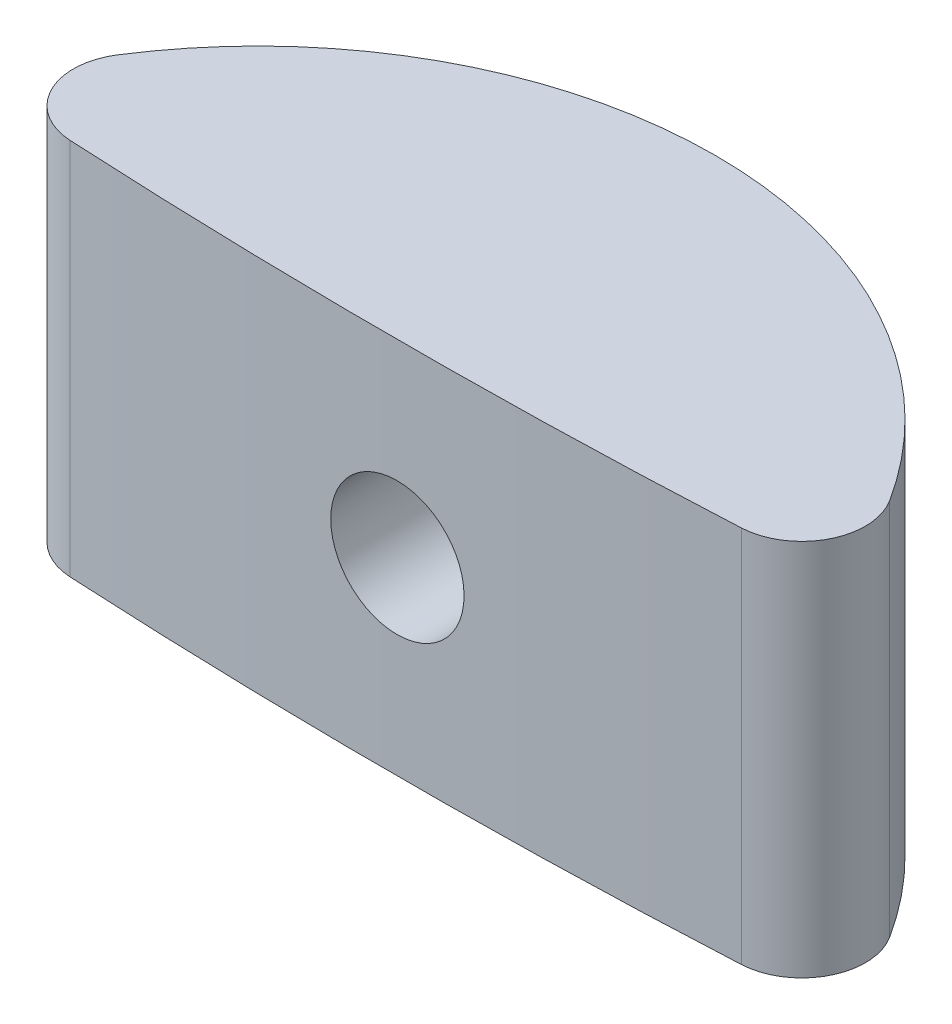
ISO-10303-21;
HEADER;
FILE_DESCRIPTION(('STEP AP214'),'2;1');
FILE_NAME('part.step','',(''),(''),'','','');
FILE_SCHEMA(('AUTOMOTIVE_DESIGN { 1 0 10303 214 1 1 1 1 }'));
ENDSEC;
DATA;
#1=APPLICATION_CONTEXT('core data for automotive mechanical design processes');
#2=APPLICATION_PROTOCOL_DEFINITION('international standard','automotive_design',2000,#1);
#3=PRODUCT_CONTEXT('',#1,'mechanical');
#4=PRODUCT('Part','Part','',(#3));
#5=PRODUCT_RELATED_PRODUCT_CATEGORY('part','',(#4));
#6=PRODUCT_DEFINITION_FORMATION('','',#4);
#7=PRODUCT_DEFINITION_CONTEXT('part definition',#1,'design');
#8=PRODUCT_DEFINITION('design','',#6,#7);
#9=PRODUCT_DEFINITION_SHAPE('','',#8);
#10=(LENGTH_UNIT() NAMED_UNIT(*) SI_UNIT(.MILLI.,.METRE.));
#11=(NAMED_UNIT(*) PLANE_ANGLE_UNIT() SI_UNIT($,.RADIAN.));
#12=(NAMED_UNIT(*) SI_UNIT($,.STERADIAN.) SOLID_ANGLE_UNIT());
#13=UNCERTAINTY_MEASURE_WITH_UNIT(LENGTH_MEASURE(1.E-05),#10,'distance_accuracy_value','');
#14=(GEOMETRIC_REPRESENTATION_CONTEXT(3) GLOBAL_UNCERTAINTY_ASSIGNED_CONTEXT((#13)) GLOBAL_UNIT_ASSIGNED_CONTEXT((#10,
#11,#12)) REPRESENTATION_CONTEXT('',''));
#15=CARTESIAN_POINT('',(0.,0.,0.));
#16=DIRECTION('',(0.,0.,1.));
#17=DIRECTION('',(1.,0.,0.));
#18=AXIS2_PLACEMENT_3D('',#15,#16,#17);
#19=CARTESIAN_POINT('',(2.33146835171283E-12,4.826,-80.010000000007));
#20=DIRECTION('',(0.,-1.,0.));
#21=DIRECTION('',(0.,0.,-1.));
#22=AXIS2_PLACEMENT_3D('',#19,#20,#21);
#23=CYLINDRICAL_SURFACE('',#22,82.0420000000049);
#24=CARTESIAN_POINT('',(2.33146835171283E-12,0.,-80.010000000007));
#25=DIRECTION('',(0.,1.,0.));
#26=DIRECTION('',(0.,0.,1.));
#27=AXIS2_PLACEMENT_3D('',#24,#25,#26);
#28=CIRCLE('',#27,82.0420000000049);
#29=CARTESIAN_POINT('',(-4.28540944867042,0.,1.92000079248676));
#30=VERTEX_POINT('',#29);
#31=CARTESIAN_POINT('',(4.28540944867114,0.,1.92000079248697));
#32=VERTEX_POINT('',#31);
#33=EDGE_CURVE('E94',#30,#32,#28,.T.);
#34=ORIENTED_EDGE('',*,*,#33,.T.);
#35=DIRECTION('',(0.,-1.,0.));
#36=VECTOR('',#35,1.);
#37=CARTESIAN_POINT('',(4.28540944867114,4.826,1.92000079248697));
#38=LINE('',#37,#36);
#39=CARTESIAN_POINT('',(4.28540944867114,4.826,1.92000079248697));
#40=VERTEX_POINT('',#39);
#41=EDGE_CURVE('E47',#40,#32,#38,.T.);
#42=ORIENTED_EDGE('',*,*,#41,.F.);
#43=CARTESIAN_POINT('',(2.33146835171283E-12,4.826,-80.010000000007));
#44=DIRECTION('',(0.,1.,0.));
#45=DIRECTION('',(0.,0.,1.));
#46=AXIS2_PLACEMENT_3D('',#43,#44,#45);
#47=CIRCLE('',#46,82.0420000000049);
#48=CARTESIAN_POINT('',(-4.28540944867042,4.826,1.92000079248676));
#49=VERTEX_POINT('',#48);
#50=EDGE_CURVE('E85',#49,#40,#47,.T.);
#51=ORIENTED_EDGE('',*,*,#50,.F.);
#52=DIRECTION('',(0.,-1.,0.));
#53=VECTOR('',#52,1.);
#54=CARTESIAN_POINT('',(-4.28540944867042,4.826,1.92000079248676));
#55=LINE('',#54,#53);
#56=EDGE_CURVE('E11',#49,#30,#55,.T.);
#57=ORIENTED_EDGE('',*,*,#56,.T.);
#58=EDGE_LOOP('',(#34,#42,#51,#57));
#59=FACE_BOUND('',#58,.T.);
#60=CARTESIAN_POINT('',(-0.8509,2.413,2.02758731940897));
#61=CARTESIAN_POINT('',(-0.85089788100523,2.36520595255424,2.02758737907313));
#62=CARTESIAN_POINT('',(-0.846859684979012,2.31737728263865,2.02762953422608));
#63=CARTESIAN_POINT('',(-0.830806610214287,2.22303726393323,2.02779364614014));
#64=CARTESIAN_POINT('',(-0.818782139031869,2.17652756951929,2.02791569886496));
#65=CARTESIAN_POINT('',(-0.78709894458625,2.0862058978376,2.02822577802736));
#66=CARTESIAN_POINT('',(-0.767443878319103,2.04239263992625,2.02841377285774));
#67=CARTESIAN_POINT('',(-0.721062478651374,1.95870005303107,2.02883451228829));
#68=CARTESIAN_POINT('',(-0.694337899740901,1.91881975134469,2.02906724578145));
#69=CARTESIAN_POINT('',(-0.634569627309472,1.84410545140068,2.02955129052397));
#70=CARTESIAN_POINT('',(-0.601525060732657,1.80927215151591,2.0298026043371));
#71=CARTESIAN_POINT('',(-0.530055641063544,1.74564627937493,2.03029546095536));
#72=CARTESIAN_POINT('',(-0.491630576425896,1.71685394474294,2.03053700337582));
#73=CARTESIAN_POINT('',(-0.410491653677468,1.66612882668587,2.0309830757621));
#74=CARTESIAN_POINT('',(-0.367777778868272,1.6441960699698,2.03118760558381));
#75=CARTESIAN_POINT('',(-0.279273924611517,1.60781303646572,2.03153659197481));
#76=CARTESIAN_POINT('',(-0.233483952083893,1.59336274284592,2.03168104867924));
#77=CARTESIAN_POINT('',(-0.1401293500264,1.57235525084038,2.03189359881309));
#78=CARTESIAN_POINT('',(-0.0925647819037192,1.56579777959618,2.03196169488232));
#79=CARTESIAN_POINT('',(0.0029901061978989,1.56076124835677,2.03201385537093));
#80=CARTESIAN_POINT('',(0.0509804252980764,1.56228217169144,2.03199791996372));
#81=CARTESIAN_POINT('',(0.146022670269315,1.5733589846484,2.03188381672275));
#82=CARTESIAN_POINT('',(0.193074631842418,1.58291456797362,2.03178565202373));
#83=CARTESIAN_POINT('',(0.284906495726545,1.6097889856677,2.03151816052323));
#84=CARTESIAN_POINT('',(0.329686395327418,1.62710782929646,2.03134883363687));
#85=CARTESIAN_POINT('',(0.415703904161632,1.66901748909446,2.03095810193782));
#86=CARTESIAN_POINT('',(0.456941445220939,1.69360844517782,2.03073669612317));
#87=CARTESIAN_POINT('',(0.534702868715446,1.74936415283854,2.03026676727125));
#88=CARTESIAN_POINT('',(0.571226751542507,1.7805289038694,2.03001824423624));
#89=CARTESIAN_POINT('',(0.638525878006982,1.8485492877809,2.02952208475845));
#90=CARTESIAN_POINT('',(0.669300850082892,1.88540518934449,2.0292744483581));
#91=CARTESIAN_POINT('',(0.724226459931421,1.96376070178939,2.02880799301252));
#92=CARTESIAN_POINT('',(0.748377096817142,2.00526031329242,2.02858917407116));
#93=CARTESIAN_POINT('',(0.789368435046018,2.09172533895105,2.02820502510215));
#94=CARTESIAN_POINT('',(0.806209128571292,2.13669075681322,2.0280396951317));
#95=CARTESIAN_POINT('',(0.832102353414275,2.22881089574756,2.0277811667182));
#96=CARTESIAN_POINT('',(0.841154887574468,2.27596561602068,2.0276879682488));
#97=CARTESIAN_POINT('',(0.85121448972571,2.37112342628937,2.02758421464095));
#98=CARTESIAN_POINT('',(0.852221932651851,2.41912647664468,2.02757365565115));
#99=CARTESIAN_POINT('',(0.846163730345619,2.51462035497763,2.02763636140732));
#100=CARTESIAN_POINT('',(0.839098085909796,2.56211118300582,2.02770962614503));
#101=CARTESIAN_POINT('',(0.817094590534489,2.65523145266441,2.02793171594202));
#102=CARTESIAN_POINT('',(0.80215690908447,2.70086093434789,2.02808053937448));
#103=CARTESIAN_POINT('',(0.764833549549312,2.78896445123984,2.02843696664815));
#104=CARTESIAN_POINT('',(0.742447870524762,2.83143848605032,2.02864457049677));
#105=CARTESIAN_POINT('',(0.690863011736532,2.91202712899718,2.02909516257378));
#106=CARTESIAN_POINT('',(0.661663579923948,2.95014157578943,2.02933815211101));
#107=CARTESIAN_POINT('',(0.597280457956959,3.02092748303808,2.02983211611657));
#108=CARTESIAN_POINT('',(0.56209676384698,3.05359893989665,2.03008309059019));
#109=CARTESIAN_POINT('',(0.486742268952576,3.11257266227948,2.03056474053494));
#110=CARTESIAN_POINT('',(0.446571277704496,3.13887468444333,2.03079541523026));
#111=CARTESIAN_POINT('',(0.362383537402801,3.18436121784954,2.03121044801646));
#112=CARTESIAN_POINT('',(0.318366792961425,3.20354573762783,2.03139480616288));
#113=CARTESIAN_POINT('',(0.227737946897198,3.23425228107829,2.03169641780145));
#114=CARTESIAN_POINT('',(0.181125899470119,3.24577446469231,2.03181367269428));
#115=CARTESIAN_POINT('',(0.0866287728709965,3.26082979432869,2.03196786416009));
#116=CARTESIAN_POINT('',(0.0387436918123193,3.26436292851062,2.03200480061404));
#117=CARTESIAN_POINT('',(-0.0569376171426161,3.26333981318263,2.03199419069435));
#118=CARTESIAN_POINT('',(-0.104733849258903,3.25878395823694,2.03194664844139));
#119=CARTESIAN_POINT('',(-0.198883098933066,3.24171297779208,2.03177244869353));
#120=CARTESIAN_POINT('',(-0.245236113592808,3.2291978363109,2.03164579103976));
#121=CARTESIAN_POINT('',(-0.335183906297855,3.19656334602581,2.03132763581885));
#122=CARTESIAN_POINT('',(-0.378778633239205,3.17644385638107,2.03113613705079));
#123=CARTESIAN_POINT('',(-0.461969924176873,3.12917268286453,2.03070989675909));
#124=CARTESIAN_POINT('',(-0.501566643594243,3.10202127250243,2.03047515691743));
#125=CARTESIAN_POINT('',(-0.575637929836373,3.04145872619714,2.02998890357115));
#126=CARTESIAN_POINT('',(-0.610112792065507,3.00804795151583,2.02973739103512));
#127=CARTESIAN_POINT('',(-0.672972837955808,2.93590307871207,2.02924586784042));
#128=CARTESIAN_POINT('',(-0.701356506591239,2.89716766014434,2.02900586005475));
#129=CARTESIAN_POINT('',(-0.75122918751752,2.81546532078416,2.02856436452567));
#130=CARTESIAN_POINT('',(-0.772714760702316,2.77249630320172,2.02836289601652));
#131=CARTESIAN_POINT('',(-0.808142253401932,2.68359444438995,2.02802159337636));
#132=CARTESIAN_POINT('',(-0.822093210672434,2.63766522830148,2.02788168544107));
#133=CARTESIAN_POINT('',(-0.838339735619991,2.56170300728784,2.02771685383285));
#134=CARTESIAN_POINT('',(-0.843043950712254,2.53216352640434,2.02766848789558));
#135=CARTESIAN_POINT('',(-0.849324745309652,2.47275387555845,2.02760370203139));
#136=CARTESIAN_POINT('',(-0.850901324922648,2.44288370560746,2.02758728210336));
#137=CARTESIAN_POINT('',(-0.8509,2.413,2.02758731940897));
#138=B_SPLINE_CURVE_WITH_KNOTS('',3,(#60,#61,#62,#63,#64,#65,#66,#67,#68,#69,#70,#71,#72,#73,
#74,#75,#76,#77,#78,#79,#80,#81,#82,#83,#84,#85,#86,#87,#88,#89,#90,#91,#92,#93,#94,#95,#96,#97,
#98,#99,#100,#101,#102,#103,#104,#105,#106,#107,#108,#109,#110,#111,#112,#113,#114,#115,#116,
#117,#118,#119,#120,#121,#122,#123,#124,#125,#126,#127,#128,#129,#130,#131,#132,#133,#134,#135,
#136,#137),.UNSPECIFIED.,.T.,.F.,(4,2,2,2,2,2,2,2,2,2,2,2,2,2,2,2,2,2,2,2,2,2,2,2,2,2,2,2,2,2,2,
2,2,2,2,2,2,2,4),(0.,0.143273066420225,0.286718532397515,0.430095336205967,0.573436590524692,
0.716797660614783,0.860164368823715,1.00353163525035,1.14689857917129,1.29026056668945,
1.43362225837384,1.57697848507568,1.7203348827711,1.86369403879698,2.007053182905,
2.15041909716264,2.2937850306148,2.4371511173944,2.58051715184894,2.72387650480422,
2.8672358436146,3.0105920959424,3.15394836635162,3.29730994052242,3.44067160945503,
3.58403875501975,3.72740572864562,3.87076970956814,4.01413390296758,4.15749110354898,
4.30084859198821,4.4442087356945,4.58756330418114,4.73090960144536,4.87429151115008,
5.01774479455754,5.16102562172082,5.25060854082584,5.34019145684145),.UNSPECIFIED.);
#139=CARTESIAN_POINT('',(-0.8509,2.413,2.02758731940897));
#140=VERTEX_POINT('',#139);
#141=EDGE_CURVE('E106',#140,#140,#138,.T.);
#142=ORIENTED_EDGE('',*,*,#141,.F.);
#143=EDGE_LOOP('',(#142));
#144=FACE_BOUND('',#143,.T.);
#145=ADVANCED_FACE('F33',(#59,#144),#23,.T.);
#146=CARTESIAN_POINT('',(2.44249065417534E-12,4.826,3.81000000000443));
#147=DIRECTION('',(0.,-1.,0.));
#148=DIRECTION('',(0.,0.,-1.));
#149=AXIS2_PLACEMENT_3D('',#146,#147,#148);
#150=CYLINDRICAL_SURFACE('',#149,5.84200000000281);
#151=CARTESIAN_POINT('',(2.44249065417534E-12,0.,3.81000000000443));
#152=DIRECTION('',(0.,1.,0.));
#153=DIRECTION('',(0.,0.,1.));
#154=AXIS2_PLACEMENT_3D('',#151,#152,#153);
#155=CIRCLE('',#154,5.84200000000281);
#156=CARTESIAN_POINT('',(4.92813652903499,0.,0.672734574311771));
#157=VERTEX_POINT('',#156);
#158=CARTESIAN_POINT('',(-4.92813652903181,0.,0.672734574314248));
#159=VERTEX_POINT('',#158);
#160=EDGE_CURVE('E78',#157,#159,#155,.T.);
#161=ORIENTED_EDGE('',*,*,#160,.T.);
#162=DIRECTION('',(0.,-1.,0.));
#163=VECTOR('',#162,1.);
#164=CARTESIAN_POINT('',(-4.92813652903181,4.826,0.672734574314248));
#165=LINE('',#164,#163);
#166=CARTESIAN_POINT('',(-4.92813652903181,4.826,0.672734574314248));
#167=VERTEX_POINT('',#166);
#168=EDGE_CURVE('E99',#167,#159,#165,.T.);
#169=ORIENTED_EDGE('',*,*,#168,.F.);
#170=CARTESIAN_POINT('',(2.44249065417534E-12,4.826,3.81000000000443));
#171=DIRECTION('',(0.,1.,0.));
#172=DIRECTION('',(0.,0.,1.));
#173=AXIS2_PLACEMENT_3D('',#170,#171,#172);
#174=CIRCLE('',#173,5.84200000000281);
#175=CARTESIAN_POINT('',(4.92813652903499,4.826,0.672734574311771));
#176=VERTEX_POINT('',#175);
#177=EDGE_CURVE('E55',#176,#167,#174,.T.);
#178=ORIENTED_EDGE('',*,*,#177,.F.);
#179=DIRECTION('',(0.,-1.,0.));
#180=VECTOR('',#179,1.);
#181=CARTESIAN_POINT('',(4.92813652903499,4.826,0.672734574311771));
#182=LINE('',#181,#180);
#183=EDGE_CURVE('E95',#176,#157,#182,.T.);
#184=ORIENTED_EDGE('',*,*,#183,.T.);
#185=EDGE_LOOP('',(#161,#169,#178,#184));
#186=FACE_BOUND('',#185,.T.);
#187=CARTESIAN_POINT('',(-0.8509,2.413,-1.96970009515869));
#188=CARTESIAN_POINT('',(-0.850898025458412,2.46052265040184,-1.96970087144942));
#189=CARTESIAN_POINT('',(-0.846905342167098,2.50807328324365,-1.97029255617358));
#190=CARTESIAN_POINT('',(-0.831043690646106,2.60184622981774,-1.97259389405576));
#191=CARTESIAN_POINT('',(-0.819166937678972,2.64806718351348,-1.97430465216345));
#192=CARTESIAN_POINT('',(-0.787899025861676,2.73780979506344,-1.97864635400047));
#193=CARTESIAN_POINT('',(-0.768513509139007,2.78133345126541,-1.98127660667208));
#194=CARTESIAN_POINT('',(-0.722791429779872,2.86450361733377,-1.98716011188831));
#195=CARTESIAN_POINT('',(-0.696455867042399,2.90415068379921,-1.99041327479674));
#196=CARTESIAN_POINT('',(-0.63736867621259,2.97874828411916,-1.99720353890273));
#197=CARTESIAN_POINT('',(-0.60457490825151,3.01366528290165,-2.0007424097027));
#198=CARTESIAN_POINT('',(-0.533593158995176,3.07752114237933,-2.00768953325025));
#199=CARTESIAN_POINT('',(-0.495404886725715,3.1064596803948,-2.01109777893943));
#200=CARTESIAN_POINT('',(-0.414503994770171,3.15766031178794,-2.01741808522771));
#201=CARTESIAN_POINT('',(-0.371771691472401,3.17989161355998,-2.02032783170275));
#202=CARTESIAN_POINT('',(-0.283130285291179,3.2168491800979,-2.02530371577308));
#203=CARTESIAN_POINT('',(-0.237221341012838,3.23157581925412,-2.02736989545096));
#204=CARTESIAN_POINT('',(-0.14387484644918,3.25300461348485,-2.0304133625361));
#205=CARTESIAN_POINT('',(-0.0964504256644733,3.2597628642323,-2.03139825851232));
#206=CARTESIAN_POINT('',(-0.00113113837466096,3.26523715883535,-2.03219424714987));
#207=CARTESIAN_POINT('',(0.0467637032701532,3.26395362541553,-2.03200540151012));
#208=CARTESIAN_POINT('',(0.14128175379036,3.25342518285763,-2.03048127809358));
#209=CARTESIAN_POINT('',(0.187911844653161,3.24424061980011,-2.02915469033743));
#210=CARTESIAN_POINT('',(0.27896180898608,3.21826548515227,-2.02551382708957));
#211=CARTESIAN_POINT('',(0.32338162820737,3.20147472697786,-2.02319952736883));
#212=CARTESIAN_POINT('',(0.408933563645707,3.1607016070688,-2.01782832174187));
#213=CARTESIAN_POINT('',(0.450053337566833,3.13669370867381,-2.01476878635903));
#214=CARTESIAN_POINT('',(0.527703352442119,3.08218643519344,-2.00824834221051));
#215=CARTESIAN_POINT('',(0.564233308090135,3.05168665688566,-2.00478740851934));
#216=CARTESIAN_POINT('',(0.632022240321159,2.98472488193841,-1.99781250749006));
#217=CARTESIAN_POINT('',(0.663229191564269,2.94821021447884,-1.99429834598354));
#218=CARTESIAN_POINT('',(0.719080368117408,2.87043449598548,-1.98764443455775));
#219=CARTESIAN_POINT('',(0.743724557264935,2.82917341879956,-1.98450468670165));
#220=CARTESIAN_POINT('',(0.785756917693217,2.74302337737062,-1.97895517730873));
#221=CARTESIAN_POINT('',(0.803139962433854,2.69813187656318,-1.97654593185179));
#222=CARTESIAN_POINT('',(0.83010541724699,2.60602371505702,-1.97273950562697));
#223=CARTESIAN_POINT('',(0.839688344174168,2.5588072086387,-1.97134225780235));
#224=CARTESIAN_POINT('',(0.850710647464449,2.46385158210796,-1.96973067003003));
#225=CARTESIAN_POINT('',(0.85222367332004,2.41612118626226,-1.96950563241628));
#226=CARTESIAN_POINT('',(0.847258446204471,2.32108824316309,-1.97023556410802));
#227=CARTESIAN_POINT('',(0.840780426558044,2.27378568345815,-1.97119049896035));
#228=CARTESIAN_POINT('',(0.82007937723467,2.18117793061723,-1.97416296421388));
#229=CARTESIAN_POINT('',(0.805892847470534,2.13586440367179,-1.97617548546242));
#230=CARTESIAN_POINT('',(0.7702153751058,2.04825857481045,-1.9810322466871));
#231=CARTESIAN_POINT('',(0.748724090818313,2.00596641433386,-1.98387652556862));
#232=CARTESIAN_POINT('',(0.698869447884375,1.92527311496846,-1.9901016072695));
#233=CARTESIAN_POINT('',(0.670458297407581,1.88690179138652,-1.99348608233536));
#234=CARTESIAN_POINT('',(0.607637056114407,1.81544545650118,-2.00039906727191));
#235=CARTESIAN_POINT('',(0.573226646050851,1.78236072670052,-2.0039275848001));
#236=CARTESIAN_POINT('',(0.499059804516152,1.72215331298098,-2.01076440984498));
#237=CARTESIAN_POINT('',(0.459263607588221,1.6950793615337,-2.01407077588382));
#238=CARTESIAN_POINT('',(0.375645338750076,1.64800112233113,-2.0200608113308));
#239=CARTESIAN_POINT('',(0.33182337183257,1.62799665026862,-2.02274449697211));
#240=CARTESIAN_POINT('',(0.241551472316232,1.59570357829456,-2.02717826736886));
#241=CARTESIAN_POINT('',(0.195111338858824,1.58338805159426,-2.02893160693246));
#242=CARTESIAN_POINT('',(0.100794825395172,1.5667352280007,-2.03132076800334));
#243=CARTESIAN_POINT('',(0.0529185347844448,1.56239743556572,-2.0319566589215));
#244=CARTESIAN_POINT('',(-0.0424380281649292,1.56183478009516,-2.03203864865555));
#245=CARTESIAN_POINT('',(-0.0899178674648379,1.56553524701658,-2.03149569814111));
#246=CARTESIAN_POINT('',(-0.183572635469804,1.58078437124258,-2.02930303074797));
#247=CARTESIAN_POINT('',(-0.229747567667333,1.59233300754014,-2.02765331683171));
#248=CARTESIAN_POINT('',(-0.319463255660908,1.6229247063615,-2.02343161431195));
#249=CARTESIAN_POINT('',(-0.363005704717922,1.64196289100924,-2.02086022608338));
#250=CARTESIAN_POINT('',(-0.446289853555012,1.68698535992727,-2.01507803303078));
#251=CARTESIAN_POINT('',(-0.4860314441594,1.71296984364143,-2.01186720984782));
#252=CARTESIAN_POINT('',(-0.560965055851801,1.77141853437605,-2.00512786961354));
#253=CARTESIAN_POINT('',(-0.596113773288636,1.80393796845227,-2.00159679606244));
#254=CARTESIAN_POINT('',(-0.660482780613404,1.8744173388243,-1.99463413751066));
#255=CARTESIAN_POINT('',(-0.689701675503214,1.9123785517296,-1.9912025760827));
#256=CARTESIAN_POINT('',(-0.741519118684373,1.9928987165142,-1.98480807758641));
#257=CARTESIAN_POINT('',(-0.764081906133975,2.03548088060643,-1.98184770985341));
#258=CARTESIAN_POINT('',(-0.801701961234314,2.12385268984788,-1.97676088065718));
#259=CARTESIAN_POINT('',(-0.816767088166443,2.16963891870935,-1.97463354648317));
#260=CARTESIAN_POINT('',(-0.835509820677577,2.24853076992496,-1.9719498604285));
#261=CARTESIAN_POINT('',(-0.841272408480555,2.28114703642282,-1.97111062005663));
#262=CARTESIAN_POINT('',(-0.848968162858077,2.34683768385959,-1.96998547044982));
#263=CARTESIAN_POINT('',(-0.85090137478685,2.3799120593681,-1.96969955466144));
#264=CARTESIAN_POINT('',(-0.8509,2.413,-1.96970009515869));
#265=B_SPLINE_CURVE_WITH_KNOTS('',3,(#187,#188,#189,#190,#191,#192,#193,#194,#195,#196,#197,
#198,#199,#200,#201,#202,#203,#204,#205,#206,#207,#208,#209,#210,#211,#212,#213,#214,#215,#216,
#217,#218,#219,#220,#221,#222,#223,#224,#225,#226,#227,#228,#229,#230,#231,#232,#233,#234,#235,
#236,#237,#238,#239,#240,#241,#242,#243,#244,#245,#246,#247,#248,#249,#250,#251,#252,#253,#254,
#255,#256,#257,#258,#259,#260,#261,#262,#263,#264),.UNSPECIFIED.,.T.,.F.,(4,2,2,2,2,2,2,2,2,2,2,
2,2,2,2,2,2,2,2,2,2,2,2,2,2,2,2,2,2,2,2,2,2,2,2,2,2,2,4),(0.,0.142447023660886,
0.285034909269796,0.427515860733897,0.569976324712606,0.71339913356506,0.85682968145752,
1.00090900779806,1.14498114564884,1.2880328745324,1.43107708381914,1.5730383603722,
1.71500311950086,1.85747623125039,1.99995819484602,2.14376154683991,2.28756569121074,
2.4314711938096,2.57536716010521,2.71794759232156,2.86052386153397,3.00243083935586,
3.14434445592625,3.28726746324717,3.43019807845708,3.5742483093886,3.71829478453363,
3.86183393498757,4.00536416912052,4.1475668093681,4.28976906898657,4.43187886646468,
4.57399274467306,4.71736236368724,4.86076567158504,5.00492595927873,5.14893481370313,
5.24811561372564,5.34729523906699),.UNSPECIFIED.);
#266=CARTESIAN_POINT('',(-0.8509,2.413,-1.96970009515869));
#267=VERTEX_POINT('',#266);
#268=EDGE_CURVE('E37',#267,#267,#265,.T.);
#269=ORIENTED_EDGE('',*,*,#268,.F.);
#270=EDGE_LOOP('',(#269));
#271=FACE_BOUND('',#270,.T.);
#272=ADVANCED_FACE('F111',(#186,#271),#150,.T.);
#273=CARTESIAN_POINT('',(-4.2429844449996,4.826,1.10890429727442));
#274=DIRECTION('',(0.,-1.,0.));
#275=DIRECTION('',(0.,0.,-1.));
#276=AXIS2_PLACEMENT_3D('',#273,#274,#275);
#277=CYLINDRICAL_SURFACE('',#276,0.81220527299545);
#278=CARTESIAN_POINT('',(-4.2429844449996,0.,1.10890429727442));
#279=DIRECTION('',(0.,1.,0.));
#280=DIRECTION('',(0.,0.,1.));
#281=AXIS2_PLACEMENT_3D('',#278,#279,#280);
#282=CIRCLE('',#281,0.81220527299545);
#283=EDGE_CURVE('E103',#159,#30,#282,.T.);
#284=ORIENTED_EDGE('',*,*,#283,.T.);
#285=ORIENTED_EDGE('',*,*,#56,.F.);
#286=CARTESIAN_POINT('',(-4.2429844449996,4.826,1.10890429727442));
#287=DIRECTION('',(0.,1.,0.));
#288=DIRECTION('',(0.,0.,1.));
#289=AXIS2_PLACEMENT_3D('',#286,#287,#288);
#290=CIRCLE('',#289,0.81220527299545);
#291=EDGE_CURVE('E90',#167,#49,#290,.T.);
#292=ORIENTED_EDGE('',*,*,#291,.F.);
#293=ORIENTED_EDGE('',*,*,#168,.T.);
#294=EDGE_LOOP('',(#284,#285,#292,#293));
#295=FACE_BOUND('',#294,.T.);
#296=ADVANCED_FACE('F35',(#295),#277,.T.);
#297=CARTESIAN_POINT('',(4.24298444500033,4.826,1.1089042972729));
#298=DIRECTION('',(0.,-1.,0.));
#299=DIRECTION('',(0.,0.,-1.));
#300=AXIS2_PLACEMENT_3D('',#297,#298,#299);
#301=CYLINDRICAL_SURFACE('',#300,0.812205272997549);
#302=CARTESIAN_POINT('',(4.24298444500033,0.,1.1089042972729));
#303=DIRECTION('',(0.,1.,0.));
#304=DIRECTION('',(0.,0.,1.));
#305=AXIS2_PLACEMENT_3D('',#302,#303,#304);
#306=CIRCLE('',#305,0.812205272997549);
#307=EDGE_CURVE('E72',#32,#157,#306,.T.);
#308=ORIENTED_EDGE('',*,*,#307,.T.);
#309=ORIENTED_EDGE('',*,*,#183,.F.);
#310=CARTESIAN_POINT('',(4.24298444500033,4.826,1.1089042972729));
#311=DIRECTION('',(0.,1.,0.));
#312=DIRECTION('',(0.,0.,1.));
#313=AXIS2_PLACEMENT_3D('',#310,#311,#312);
#314=CIRCLE('',#313,0.812205272997549);
#315=EDGE_CURVE('E88',#40,#176,#314,.T.);
#316=ORIENTED_EDGE('',*,*,#315,.F.);
#317=ORIENTED_EDGE('',*,*,#41,.T.);
#318=EDGE_LOOP('',(#308,#309,#316,#317));
#319=FACE_BOUND('',#318,.T.);
#320=ADVANCED_FACE('F97',(#319),#301,.T.);
#321=CARTESIAN_POINT('',(-2.12149222249863,4.826,-39.4505478513663));
#322=DIRECTION('',(0.,1.,0.));
#323=DIRECTION('',(0.,0.,1.));
#324=AXIS2_PLACEMENT_3D('',#321,#322,#323);
#325=PLANE('',#324);
#326=ORIENTED_EDGE('',*,*,#291,.T.);
#327=ORIENTED_EDGE('',*,*,#50,.T.);
#328=ORIENTED_EDGE('',*,*,#315,.T.);
#329=ORIENTED_EDGE('',*,*,#177,.T.);
#330=EDGE_LOOP('',(#326,#327,#328,#329));
#331=FACE_BOUND('',#330,.T.);
#332=ADVANCED_FACE('F86',(#331),#325,.T.);
#333=CARTESIAN_POINT('',(-2.12149222249863,0.,-39.4505478513663));
#334=DIRECTION('',(0.,1.,0.));
#335=DIRECTION('',(0.,0.,1.));
#336=AXIS2_PLACEMENT_3D('',#333,#334,#335);
#337=PLANE('',#336);
#338=ORIENTED_EDGE('',*,*,#283,.F.);
#339=ORIENTED_EDGE('',*,*,#160,.F.);
#340=ORIENTED_EDGE('',*,*,#307,.F.);
#341=ORIENTED_EDGE('',*,*,#33,.F.);
#342=EDGE_LOOP('',(#338,#339,#340,#341));
#343=FACE_BOUND('',#342,.T.);
#344=ADVANCED_FACE('F115',(#343),#337,.F.);
#345=CARTESIAN_POINT('',(0.,2.413,4.826));
#346=DIRECTION('',(0.,0.,-1.));
#347=DIRECTION('',(-1.,0.,0.));
#348=AXIS2_PLACEMENT_3D('',#345,#346,#347);
#349=CYLINDRICAL_SURFACE('',#348,0.8509);
#350=ORIENTED_EDGE('',*,*,#268,.T.);
#351=EDGE_LOOP('',(#350));
#352=FACE_BOUND('',#351,.T.);
#353=ORIENTED_EDGE('',*,*,#141,.T.);
#354=EDGE_LOOP('',(#353));
#355=FACE_BOUND('',#354,.T.);
#356=ADVANCED_FACE('F123',(#352,#355),#349,.F.);
#357=CLOSED_SHELL('',(#145,#272,#296,#320,#332,#344,#356));
#358=MANIFOLD_SOLID_BREP('B2',#357);
#359=ADVANCED_BREP_SHAPE_REPRESENTATION('',(#18,#358),#14);
#360=SHAPE_DEFINITION_REPRESENTATION(#9,#359);
ENDSEC;
END-ISO-10303-21;
